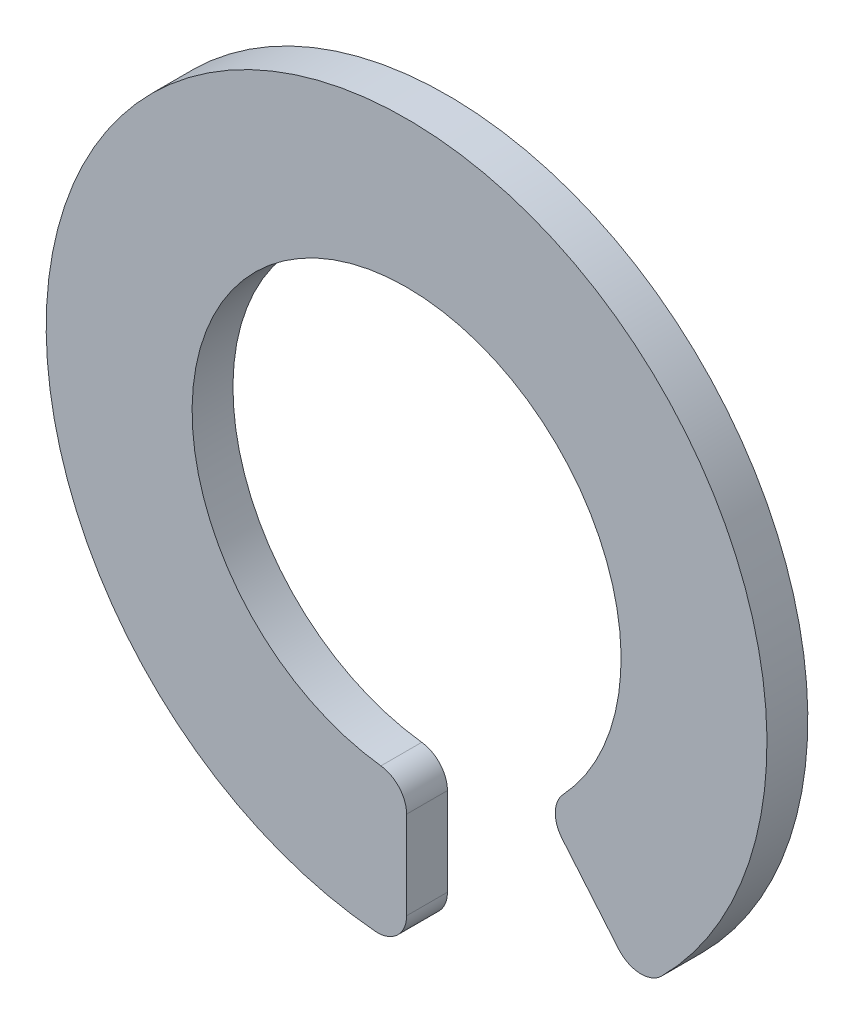
ISO-10303-21;
HEADER;
FILE_DESCRIPTION(('STEP AP214'),'2;1');
FILE_NAME('part.step','',(''),(''),'','','');
FILE_SCHEMA(('AUTOMOTIVE_DESIGN { 1 0 10303 214 1 1 1 1 }'));
ENDSEC;
DATA;
#1=APPLICATION_CONTEXT('core data for automotive mechanical design processes');
#2=APPLICATION_PROTOCOL_DEFINITION('international standard','automotive_design',2000,#1);
#3=PRODUCT_CONTEXT('',#1,'mechanical');
#4=PRODUCT('Part','Part','',(#3));
#5=PRODUCT_RELATED_PRODUCT_CATEGORY('part','',(#4));
#6=PRODUCT_DEFINITION_FORMATION('','',#4);
#7=PRODUCT_DEFINITION_CONTEXT('part definition',#1,'design');
#8=PRODUCT_DEFINITION('design','',#6,#7);
#9=PRODUCT_DEFINITION_SHAPE('','',#8);
#10=(LENGTH_UNIT() NAMED_UNIT(*) SI_UNIT(.MILLI.,.METRE.));
#11=(NAMED_UNIT(*) PLANE_ANGLE_UNIT() SI_UNIT($,.RADIAN.));
#12=(NAMED_UNIT(*) SI_UNIT($,.STERADIAN.) SOLID_ANGLE_UNIT());
#13=UNCERTAINTY_MEASURE_WITH_UNIT(LENGTH_MEASURE(1.E-05),#10,'distance_accuracy_value','');
#14=(GEOMETRIC_REPRESENTATION_CONTEXT(3) GLOBAL_UNCERTAINTY_ASSIGNED_CONTEXT((#13)) GLOBAL_UNIT_ASSIGNED_CONTEXT((#10,
#11,#12)) REPRESENTATION_CONTEXT('',''));
#15=CARTESIAN_POINT('',(0.,0.,0.));
#16=DIRECTION('',(0.,0.,1.));
#17=DIRECTION('',(1.,0.,0.));
#18=AXIS2_PLACEMENT_3D('',#15,#16,#17);
#19=CARTESIAN_POINT('',(0.,0.,0.28));
#20=DIRECTION('',(0.,0.,-1.));
#21=DIRECTION('',(-1.,0.,0.));
#22=AXIS2_PLACEMENT_3D('',#19,#20,#21);
#23=CYLINDRICAL_SURFACE('',#22,1.47);
#24=CARTESIAN_POINT('',(0.,0.,0.));
#25=DIRECTION('',(0.,0.,-1.));
#26=DIRECTION('',(1.,0.,0.));
#27=AXIS2_PLACEMENT_3D('',#24,#25,#26);
#28=CIRCLE('',#27,1.47);
#29=CARTESIAN_POINT('',(-0.176047904191617,-1.45942013670832,0.));
#30=VERTEX_POINT('',#29);
#31=CARTESIAN_POINT('',(1.07295769993188,-1.00481927437569,0.));
#32=VERTEX_POINT('',#31);
#33=EDGE_CURVE('E138',#30,#32,#28,.T.);
#34=ORIENTED_EDGE('',*,*,#33,.T.);
#35=DIRECTION('',(0.,0.,-1.));
#36=VECTOR('',#35,1.);
#37=CARTESIAN_POINT('',(1.07295769993188,-1.00481927437569,0.28));
#38=LINE('',#37,#36);
#39=CARTESIAN_POINT('',(1.07295769993188,-1.00481927437569,0.28));
#40=VERTEX_POINT('',#39);
#41=EDGE_CURVE('E160',#32,#40,#38,.F.);
#42=ORIENTED_EDGE('',*,*,#41,.T.);
#43=CARTESIAN_POINT('',(0.,0.,0.28));
#44=DIRECTION('',(0.,0.,-1.));
#45=DIRECTION('',(1.,0.,0.));
#46=AXIS2_PLACEMENT_3D('',#43,#44,#45);
#47=CIRCLE('',#46,1.47);
#48=CARTESIAN_POINT('',(-0.176047904191617,-1.45942013670832,0.28));
#49=VERTEX_POINT('',#48);
#50=EDGE_CURVE('E136',#49,#40,#47,.T.);
#51=ORIENTED_EDGE('',*,*,#50,.F.);
#52=DIRECTION('',(0.,0.,-1.));
#53=VECTOR('',#52,1.);
#54=CARTESIAN_POINT('',(-0.176047904191617,-1.45942013670832,0.28));
#55=LINE('',#54,#53);
#56=EDGE_CURVE('E157',#49,#30,#55,.T.);
#57=ORIENTED_EDGE('',*,*,#56,.T.);
#58=EDGE_LOOP('',(#34,#42,#51,#57));
#59=FACE_BOUND('',#58,.T.);
#60=ADVANCED_FACE('F41',(#59),#23,.F.);
#61=CARTESIAN_POINT('',(0.944897786239215,-1.1260853313849,0.28));
#62=DIRECTION('',(0.766044443118977,0.642787609686541,0.));
#63=DIRECTION('',(-0.642787609686541,0.766044443118977,0.));
#64=AXIS2_PLACEMENT_3D('',#61,#62,#63);
#65=PLANE('',#64);
#66=DIRECTION('',(0.642787609686541,-0.766044443118977,0.));
#67=VECTOR('',#66,1.);
#68=CARTESIAN_POINT('',(0.944897786239215,-1.1260853313849,0.));
#69=LINE('',#68,#67);
#70=CARTESIAN_POINT('',(1.0657294507546,-1.27008690167024,0.));
#71=VERTEX_POINT('',#70);
#72=CARTESIAN_POINT('',(1.45345351360248,-1.73215844650442,0.));
#73=VERTEX_POINT('',#72);
#74=EDGE_CURVE('E134',#71,#73,#69,.T.);
#75=ORIENTED_EDGE('',*,*,#74,.T.);
#76=DIRECTION('',(0.,0.,-1.));
#77=VECTOR('',#76,1.);
#78=CARTESIAN_POINT('',(1.45345351360248,-1.73215844650442,0.28));
#79=LINE('',#78,#77);
#80=CARTESIAN_POINT('',(1.45345351360248,-1.73215844650442,0.28));
#81=VERTEX_POINT('',#80);
#82=EDGE_CURVE('E112',#73,#81,#79,.F.);
#83=ORIENTED_EDGE('',*,*,#82,.T.);
#84=DIRECTION('',(0.642787609686541,-0.766044443118977,0.));
#85=VECTOR('',#84,1.);
#86=CARTESIAN_POINT('',(0.944897786239215,-1.1260853313849,0.28));
#87=LINE('',#86,#85);
#88=CARTESIAN_POINT('',(1.0657294507546,-1.27008690167024,0.28));
#89=VERTEX_POINT('',#88);
#90=EDGE_CURVE('E174',#89,#81,#87,.T.);
#91=ORIENTED_EDGE('',*,*,#90,.F.);
#92=DIRECTION('',(0.,0.,-1.));
#93=VECTOR('',#92,1.);
#94=CARTESIAN_POINT('',(1.0657294507546,-1.27008690167024,0.28));
#95=LINE('',#94,#93);
#96=EDGE_CURVE('E117',#89,#71,#95,.T.);
#97=ORIENTED_EDGE('',*,*,#96,.T.);
#98=EDGE_LOOP('',(#75,#83,#91,#97));
#99=FACE_BOUND('',#98,.T.);
#100=ADVANCED_FACE('F179',(#99),#65,.F.);
#101=CARTESIAN_POINT('',(0.,0.,0.28));
#102=DIRECTION('',(0.,0.,-1.));
#103=DIRECTION('',(-1.,0.,0.));
#104=AXIS2_PLACEMENT_3D('',#101,#102,#103);
#105=CYLINDRICAL_SURFACE('',#104,2.47);
#106=CARTESIAN_POINT('',(0.,0.,0.28));
#107=DIRECTION('',(0.,0.,1.));
#108=DIRECTION('',(1.,0.,0.));
#109=AXIS2_PLACEMENT_3D('',#106,#107,#108);
#110=CIRCLE('',#109,2.47);
#111=CARTESIAN_POINT('',(1.74821856101273,-1.74488734963911,0.28));
#112=VERTEX_POINT('',#111);
#113=CARTESIAN_POINT('',(-0.217621145374449,-2.46039448810265,0.28));
#114=VERTEX_POINT('',#113);
#115=EDGE_CURVE('E126',#112,#114,#110,.T.);
#116=ORIENTED_EDGE('',*,*,#115,.F.);
#117=DIRECTION('',(0.,0.,-1.));
#118=VECTOR('',#117,1.);
#119=CARTESIAN_POINT('',(1.74821856101273,-1.74488734963911,0.28));
#120=LINE('',#119,#118);
#121=CARTESIAN_POINT('',(1.74821856101273,-1.74488734963911,0.));
#122=VERTEX_POINT('',#121);
#123=EDGE_CURVE('E111',#112,#122,#120,.T.);
#124=ORIENTED_EDGE('',*,*,#123,.T.);
#125=CARTESIAN_POINT('',(0.,0.,0.));
#126=DIRECTION('',(0.,0.,1.));
#127=DIRECTION('',(1.,0.,0.));
#128=AXIS2_PLACEMENT_3D('',#125,#126,#127);
#129=CIRCLE('',#128,2.47);
#130=CARTESIAN_POINT('',(-0.217621145374449,-2.46039448810265,0.));
#131=VERTEX_POINT('',#130);
#132=EDGE_CURVE('E124',#122,#131,#129,.T.);
#133=ORIENTED_EDGE('',*,*,#132,.T.);
#134=DIRECTION('',(0.,0.,-1.));
#135=VECTOR('',#134,1.);
#136=CARTESIAN_POINT('',(-0.217621145374449,-2.46039448810265,0.28));
#137=LINE('',#136,#135);
#138=EDGE_CURVE('E128',#131,#114,#137,.F.);
#139=ORIENTED_EDGE('',*,*,#138,.T.);
#140=EDGE_LOOP('',(#116,#124,#133,#139));
#141=FACE_BOUND('',#140,.T.);
#142=ADVANCED_FACE('F123',(#141),#105,.T.);
#143=CARTESIAN_POINT('',(0.,-1.47,0.28));
#144=DIRECTION('',(-1.,0.,0.));
#145=DIRECTION('',(0.,0.,1.));
#146=AXIS2_PLACEMENT_3D('',#143,#144,#145);
#147=PLANE('',#146);
#148=DIRECTION('',(0.,1.,0.));
#149=VECTOR('',#148,1.);
#150=CARTESIAN_POINT('',(0.,-1.47,0.28));
#151=LINE('',#150,#149);
#152=CARTESIAN_POINT('',(0.,-2.26117226234535,0.28));
#153=VERTEX_POINT('',#152);
#154=CARTESIAN_POINT('',(0.,-1.65798069952578,0.28));
#155=VERTEX_POINT('',#154);
#156=EDGE_CURVE('E142',#153,#155,#151,.T.);
#157=ORIENTED_EDGE('',*,*,#156,.F.);
#158=DIRECTION('',(0.,0.,-1.));
#159=VECTOR('',#158,1.);
#160=CARTESIAN_POINT('',(0.,-2.26117226234535,0.28));
#161=LINE('',#160,#159);
#162=CARTESIAN_POINT('',(0.,-2.26117226234535,0.));
#163=VERTEX_POINT('',#162);
#164=EDGE_CURVE('E11',#153,#163,#161,.T.);
#165=ORIENTED_EDGE('',*,*,#164,.T.);
#166=DIRECTION('',(0.,1.,0.));
#167=VECTOR('',#166,1.);
#168=CARTESIAN_POINT('',(0.,-1.47,0.));
#169=LINE('',#168,#167);
#170=CARTESIAN_POINT('',(0.,-1.65798069952578,0.));
#171=VERTEX_POINT('',#170);
#172=EDGE_CURVE('E133',#163,#171,#169,.T.);
#173=ORIENTED_EDGE('',*,*,#172,.T.);
#174=DIRECTION('',(0.,0.,-1.));
#175=VECTOR('',#174,1.);
#176=CARTESIAN_POINT('',(0.,-1.65798069952578,0.28));
#177=LINE('',#176,#175);
#178=EDGE_CURVE('E49',#171,#155,#177,.F.);
#179=ORIENTED_EDGE('',*,*,#178,.T.);
#180=EDGE_LOOP('',(#157,#165,#173,#179));
#181=FACE_BOUND('',#180,.T.);
#182=ADVANCED_FACE('F186',(#181),#147,.F.);
#183=CARTESIAN_POINT('',(0.,0.,0.28));
#184=DIRECTION('',(0.,0.,1.));
#185=DIRECTION('',(1.,0.,0.));
#186=AXIS2_PLACEMENT_3D('',#183,#184,#185);
#187=PLANE('',#186);
#188=ORIENTED_EDGE('',*,*,#90,.T.);
#189=CARTESIAN_POINT('',(1.60666240222627,-1.60360092456711,0.28));
#190=DIRECTION('',(0.,0.,1.));
#191=DIRECTION('',(1.,0.,0.));
#192=AXIS2_PLACEMENT_3D('',#189,#190,#191);
#193=CIRCLE('',#192,0.2);
#194=EDGE_CURVE('E155',#81,#112,#193,.T.);
#195=ORIENTED_EDGE('',*,*,#194,.T.);
#196=ORIENTED_EDGE('',*,*,#115,.T.);
#197=CARTESIAN_POINT('',(-0.2,-2.26117226234535,0.28));
#198=DIRECTION('',(0.,0.,1.));
#199=DIRECTION('',(1.,0.,0.));
#200=AXIS2_PLACEMENT_3D('',#197,#198,#199);
#201=CIRCLE('',#200,0.2);
#202=EDGE_CURVE('E62',#114,#153,#201,.T.);
#203=ORIENTED_EDGE('',*,*,#202,.T.);
#204=ORIENTED_EDGE('',*,*,#156,.T.);
#205=CARTESIAN_POINT('',(-0.2,-1.65798069952578,0.28));
#206=DIRECTION('',(0.,0.,1.));
#207=DIRECTION('',(1.,0.,0.));
#208=AXIS2_PLACEMENT_3D('',#205,#206,#207);
#209=CIRCLE('',#208,0.2);
#210=EDGE_CURVE('E150',#155,#49,#209,.T.);
#211=ORIENTED_EDGE('',*,*,#210,.T.);
#212=ORIENTED_EDGE('',*,*,#50,.T.);
#213=CARTESIAN_POINT('',(1.21893833937839,-1.14152937973293,0.28));
#214=DIRECTION('',(0.,0.,1.));
#215=DIRECTION('',(1.,0.,0.));
#216=AXIS2_PLACEMENT_3D('',#213,#214,#215);
#217=CIRCLE('',#216,0.2);
#218=EDGE_CURVE('E153',#40,#89,#217,.T.);
#219=ORIENTED_EDGE('',*,*,#218,.T.);
#220=EDGE_LOOP('',(#188,#195,#196,#203,#204,#211,#212,#219));
#221=FACE_BOUND('',#220,.T.);
#222=ADVANCED_FACE('F171',(#221),#187,.T.);
#223=CARTESIAN_POINT('',(0.,0.,0.));
#224=DIRECTION('',(0.,0.,1.));
#225=DIRECTION('',(1.,0.,0.));
#226=AXIS2_PLACEMENT_3D('',#223,#224,#225);
#227=PLANE('',#226);
#228=ORIENTED_EDGE('',*,*,#132,.F.);
#229=CARTESIAN_POINT('',(1.60666240222627,-1.60360092456711,0.));
#230=DIRECTION('',(0.,0.,1.));
#231=DIRECTION('',(1.,0.,0.));
#232=AXIS2_PLACEMENT_3D('',#229,#230,#231);
#233=CIRCLE('',#232,0.2);
#234=EDGE_CURVE('E107',#122,#73,#233,.F.);
#235=ORIENTED_EDGE('',*,*,#234,.T.);
#236=ORIENTED_EDGE('',*,*,#74,.F.);
#237=CARTESIAN_POINT('',(1.21893833937839,-1.14152937973293,0.));
#238=DIRECTION('',(0.,0.,1.));
#239=DIRECTION('',(1.,0.,0.));
#240=AXIS2_PLACEMENT_3D('',#237,#238,#239);
#241=CIRCLE('',#240,0.2);
#242=EDGE_CURVE('E118',#71,#32,#241,.F.);
#243=ORIENTED_EDGE('',*,*,#242,.T.);
#244=ORIENTED_EDGE('',*,*,#33,.F.);
#245=CARTESIAN_POINT('',(-0.2,-1.65798069952578,0.));
#246=DIRECTION('',(0.,0.,1.));
#247=DIRECTION('',(1.,0.,0.));
#248=AXIS2_PLACEMENT_3D('',#245,#246,#247);
#249=CIRCLE('',#248,0.2);
#250=EDGE_CURVE('E127',#30,#171,#249,.F.);
#251=ORIENTED_EDGE('',*,*,#250,.T.);
#252=ORIENTED_EDGE('',*,*,#172,.F.);
#253=CARTESIAN_POINT('',(-0.2,-2.26117226234535,0.));
#254=DIRECTION('',(0.,0.,1.));
#255=DIRECTION('',(1.,0.,0.));
#256=AXIS2_PLACEMENT_3D('',#253,#254,#255);
#257=CIRCLE('',#256,0.2);
#258=EDGE_CURVE('E132',#163,#131,#257,.F.);
#259=ORIENTED_EDGE('',*,*,#258,.T.);
#260=EDGE_LOOP('',(#228,#235,#236,#243,#244,#251,#252,#259));
#261=FACE_BOUND('',#260,.T.);
#262=ADVANCED_FACE('F130',(#261),#227,.F.);
#263=CARTESIAN_POINT('',(1.60666240222627,-1.60360092456711,0.28));
#264=DIRECTION('',(0.,0.,-1.));
#265=DIRECTION('',(-1.,0.,0.));
#266=AXIS2_PLACEMENT_3D('',#263,#264,#265);
#267=CYLINDRICAL_SURFACE('',#266,0.2);
#268=ORIENTED_EDGE('',*,*,#194,.F.);
#269=ORIENTED_EDGE('',*,*,#82,.F.);
#270=ORIENTED_EDGE('',*,*,#234,.F.);
#271=ORIENTED_EDGE('',*,*,#123,.F.);
#272=EDGE_LOOP('',(#268,#269,#270,#271));
#273=FACE_BOUND('',#272,.T.);
#274=ADVANCED_FACE('F110',(#273),#267,.T.);
#275=CARTESIAN_POINT('',(1.21893833937839,-1.14152937973293,0.28));
#276=DIRECTION('',(0.,0.,-1.));
#277=DIRECTION('',(-1.,0.,0.));
#278=AXIS2_PLACEMENT_3D('',#275,#276,#277);
#279=CYLINDRICAL_SURFACE('',#278,0.2);
#280=ORIENTED_EDGE('',*,*,#218,.F.);
#281=ORIENTED_EDGE('',*,*,#41,.F.);
#282=ORIENTED_EDGE('',*,*,#242,.F.);
#283=ORIENTED_EDGE('',*,*,#96,.F.);
#284=EDGE_LOOP('',(#280,#281,#282,#283));
#285=FACE_BOUND('',#284,.T.);
#286=ADVANCED_FACE('F177',(#285),#279,.T.);
#287=CARTESIAN_POINT('',(-0.2,-2.26117226234535,0.28));
#288=DIRECTION('',(0.,0.,-1.));
#289=DIRECTION('',(-1.,0.,0.));
#290=AXIS2_PLACEMENT_3D('',#287,#288,#289);
#291=CYLINDRICAL_SURFACE('',#290,0.2);
#292=ORIENTED_EDGE('',*,*,#202,.F.);
#293=ORIENTED_EDGE('',*,*,#138,.F.);
#294=ORIENTED_EDGE('',*,*,#258,.F.);
#295=ORIENTED_EDGE('',*,*,#164,.F.);
#296=EDGE_LOOP('',(#292,#293,#294,#295));
#297=FACE_BOUND('',#296,.T.);
#298=ADVANCED_FACE('F185',(#297),#291,.T.);
#299=CARTESIAN_POINT('',(-0.2,-1.65798069952578,0.28));
#300=DIRECTION('',(0.,0.,-1.));
#301=DIRECTION('',(-1.,0.,0.));
#302=AXIS2_PLACEMENT_3D('',#299,#300,#301);
#303=CYLINDRICAL_SURFACE('',#302,0.2);
#304=ORIENTED_EDGE('',*,*,#210,.F.);
#305=ORIENTED_EDGE('',*,*,#178,.F.);
#306=ORIENTED_EDGE('',*,*,#250,.F.);
#307=ORIENTED_EDGE('',*,*,#56,.F.);
#308=EDGE_LOOP('',(#304,#305,#306,#307));
#309=FACE_BOUND('',#308,.T.);
#310=ADVANCED_FACE('F43',(#309),#303,.T.);
#311=CLOSED_SHELL('',(#60,#100,#142,#182,#222,#262,#274,#286,#298,#310));
#312=MANIFOLD_SOLID_BREP('B2',#311);
#313=ADVANCED_BREP_SHAPE_REPRESENTATION('',(#18,#312),#14);
#314=SHAPE_DEFINITION_REPRESENTATION(#9,#313);
ENDSEC;
END-ISO-10303-21;
